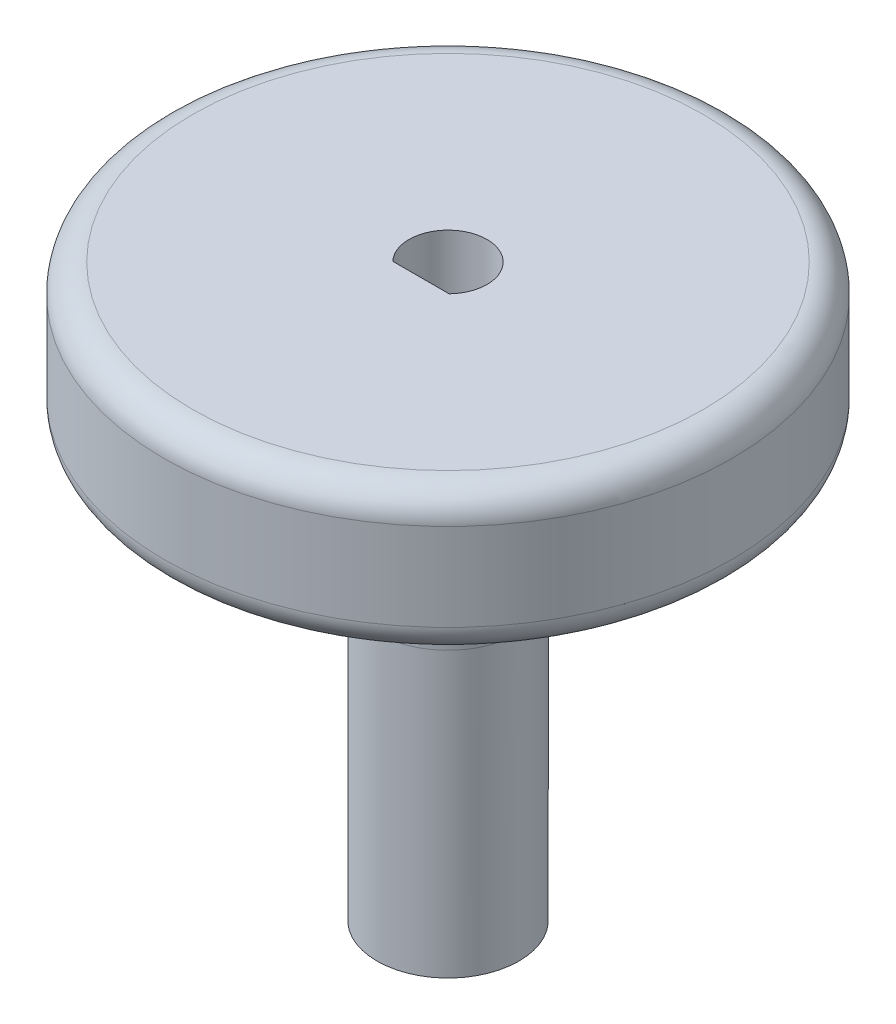
ISO-10303-21;
HEADER;
FILE_DESCRIPTION(('STEP AP214'),'2;1');
FILE_NAME('part.step','',(''),(''),'','','');
FILE_SCHEMA(('AUTOMOTIVE_DESIGN { 1 0 10303 214 1 1 1 1 }'));
ENDSEC;
DATA;
#1=APPLICATION_CONTEXT('core data for automotive mechanical design processes');
#2=APPLICATION_PROTOCOL_DEFINITION('international standard','automotive_design',2000,#1);
#3=PRODUCT_CONTEXT('',#1,'mechanical');
#4=PRODUCT('Part','Part','',(#3));
#5=PRODUCT_RELATED_PRODUCT_CATEGORY('part','',(#4));
#6=PRODUCT_DEFINITION_FORMATION('','',#4);
#7=PRODUCT_DEFINITION_CONTEXT('part definition',#1,'design');
#8=PRODUCT_DEFINITION('design','',#6,#7);
#9=PRODUCT_DEFINITION_SHAPE('','',#8);
#10=(LENGTH_UNIT() NAMED_UNIT(*) SI_UNIT(.MILLI.,.METRE.));
#11=(NAMED_UNIT(*) PLANE_ANGLE_UNIT() SI_UNIT($,.RADIAN.));
#12=(NAMED_UNIT(*) SI_UNIT($,.STERADIAN.) SOLID_ANGLE_UNIT());
#13=UNCERTAINTY_MEASURE_WITH_UNIT(LENGTH_MEASURE(1.E-05),#10,'distance_accuracy_value','');
#14=(GEOMETRIC_REPRESENTATION_CONTEXT(3) GLOBAL_UNCERTAINTY_ASSIGNED_CONTEXT((#13)) GLOBAL_UNIT_ASSIGNED_CONTEXT((#10,
#11,#12)) REPRESENTATION_CONTEXT('',''));
#15=CARTESIAN_POINT('',(0.,0.,0.));
#16=DIRECTION('',(0.,0.,1.));
#17=DIRECTION('',(1.,0.,0.));
#18=AXIS2_PLACEMENT_3D('',#15,#16,#17);
#19=CARTESIAN_POINT('',(0.,10.16,0.));
#20=DIRECTION('',(0.,-1.,0.));
#21=DIRECTION('',(0.,0.,-1.));
#22=AXIS2_PLACEMENT_3D('',#19,#20,#21);
#23=CYLINDRICAL_SURFACE('',#22,20.);
#24=CARTESIAN_POINT('',(0.,8.16,0.));
#25=DIRECTION('',(0.,1.,0.));
#26=DIRECTION('',(0.,0.,1.));
#27=AXIS2_PLACEMENT_3D('',#24,#25,#26);
#28=CIRCLE('',#27,20.);
#29=CARTESIAN_POINT('',(0.,8.16,20.));
#30=VERTEX_POINT('',#29);
#31=EDGE_CURVE('E41',#30,#30,#28,.F.);
#32=ORIENTED_EDGE('',*,*,#31,.T.);
#33=EDGE_LOOP('',(#32));
#34=FACE_BOUND('',#33,.T.);
#35=CARTESIAN_POINT('',(0.,2.,0.));
#36=DIRECTION('',(0.,1.,0.));
#37=DIRECTION('',(0.,0.,1.));
#38=AXIS2_PLACEMENT_3D('',#35,#36,#37);
#39=CIRCLE('',#38,20.);
#40=CARTESIAN_POINT('',(0.,2.,20.));
#41=VERTEX_POINT('',#40);
#42=EDGE_CURVE('E90',#41,#41,#39,.T.);
#43=ORIENTED_EDGE('',*,*,#42,.T.);
#44=EDGE_LOOP('',(#43));
#45=FACE_BOUND('',#44,.T.);
#46=ADVANCED_FACE('F33',(#34,#45),#23,.T.);
#47=CARTESIAN_POINT('',(0.,10.16,0.));
#48=DIRECTION('',(0.,1.,0.));
#49=DIRECTION('',(0.,0.,1.));
#50=AXIS2_PLACEMENT_3D('',#47,#48,#49);
#51=PLANE('',#50);
#52=CARTESIAN_POINT('',(0.,10.16,0.));
#53=DIRECTION('',(0.,1.,0.));
#54=DIRECTION('',(0.,0.,1.));
#55=AXIS2_PLACEMENT_3D('',#52,#53,#54);
#56=CIRCLE('',#55,18.);
#57=CARTESIAN_POINT('',(0.,10.16,18.));
#58=VERTEX_POINT('',#57);
#59=EDGE_CURVE('E87',#58,#58,#56,.T.);
#60=ORIENTED_EDGE('',*,*,#59,.T.);
#61=EDGE_LOOP('',(#60));
#62=FACE_BOUND('',#61,.T.);
#63=DIRECTION('',(-1.,0.,0.));
#64=VECTOR('',#63,1.);
#65=CARTESIAN_POINT('',(-1.98329901931101,10.16,1.905));
#66=LINE('',#65,#64);
#67=CARTESIAN_POINT('',(1.98329901931101,10.16,1.905));
#68=VERTEX_POINT('',#67);
#69=CARTESIAN_POINT('',(-1.98329901931101,10.16,1.905));
#70=VERTEX_POINT('',#69);
#71=EDGE_CURVE('E69',#68,#70,#66,.T.);
#72=ORIENTED_EDGE('',*,*,#71,.T.);
#73=CARTESIAN_POINT('',(0.,10.16,0.));
#74=DIRECTION('',(0.,1.,0.));
#75=DIRECTION('',(0.,0.,1.));
#76=AXIS2_PLACEMENT_3D('',#73,#74,#75);
#77=CIRCLE('',#76,2.75);
#78=EDGE_CURVE('E61',#70,#68,#77,.F.);
#79=ORIENTED_EDGE('',*,*,#78,.T.);
#80=EDGE_LOOP('',(#72,#79));
#81=FACE_BOUND('',#80,.T.);
#82=ADVANCED_FACE('F71',(#62,#81),#51,.T.);
#83=CARTESIAN_POINT('',(0.,0.,0.));
#84=DIRECTION('',(0.,1.,0.));
#85=DIRECTION('',(0.,0.,1.));
#86=AXIS2_PLACEMENT_3D('',#83,#84,#85);
#87=PLANE('',#86);
#88=CARTESIAN_POINT('',(0.,0.,0.));
#89=DIRECTION('',(0.,1.,0.));
#90=DIRECTION('',(0.,0.,1.));
#91=AXIS2_PLACEMENT_3D('',#88,#89,#90);
#92=CIRCLE('',#91,18.);
#93=CARTESIAN_POINT('',(0.,0.,18.));
#94=VERTEX_POINT('',#93);
#95=EDGE_CURVE('E11',#94,#94,#92,.F.);
#96=ORIENTED_EDGE('',*,*,#95,.T.);
#97=EDGE_LOOP('',(#96));
#98=FACE_BOUND('',#97,.T.);
#99=CARTESIAN_POINT('',(0.,0.,0.));
#100=DIRECTION('',(0.,1.,0.));
#101=DIRECTION('',(0.,0.,1.));
#102=AXIS2_PLACEMENT_3D('',#99,#100,#101);
#103=CIRCLE('',#102,15.);
#104=CARTESIAN_POINT('',(0.,0.,15.));
#105=VERTEX_POINT('',#104);
#106=EDGE_CURVE('E84',#105,#105,#103,.T.);
#107=ORIENTED_EDGE('',*,*,#106,.T.);
#108=EDGE_LOOP('',(#107));
#109=FACE_BOUND('',#108,.T.);
#110=ADVANCED_FACE('F104',(#98,#109),#87,.F.);
#111=CARTESIAN_POINT('',(0.,-30.,0.));
#112=DIRECTION('',(0.,1.,0.));
#113=DIRECTION('',(0.,0.,1.));
#114=AXIS2_PLACEMENT_3D('',#111,#112,#113);
#115=CYLINDRICAL_SURFACE('',#114,5.);
#116=CARTESIAN_POINT('',(0.,-10.,0.));
#117=DIRECTION('',(0.,1.,0.));
#118=DIRECTION('',(0.,0.,1.));
#119=AXIS2_PLACEMENT_3D('',#116,#117,#118);
#120=CIRCLE('',#119,5.);
#121=CARTESIAN_POINT('',(0.,-10.,5.));
#122=VERTEX_POINT('',#121);
#123=EDGE_CURVE('E81',#122,#122,#120,.F.);
#124=ORIENTED_EDGE('',*,*,#123,.T.);
#125=EDGE_LOOP('',(#124));
#126=FACE_BOUND('',#125,.T.);
#127=CARTESIAN_POINT('',(0.,-30.,0.));
#128=DIRECTION('',(0.,-1.,0.));
#129=DIRECTION('',(0.,0.,-1.));
#130=AXIS2_PLACEMENT_3D('',#127,#128,#129);
#131=CIRCLE('',#130,5.);
#132=CARTESIAN_POINT('',(0.,-30.,-5.));
#133=VERTEX_POINT('',#132);
#134=EDGE_CURVE('E78',#133,#133,#131,.T.);
#135=ORIENTED_EDGE('',*,*,#134,.F.);
#136=EDGE_LOOP('',(#135));
#137=FACE_BOUND('',#136,.T.);
#138=ADVANCED_FACE('F110',(#126,#137),#115,.T.);
#139=CARTESIAN_POINT('',(0.,-30.,0.));
#140=DIRECTION('',(0.,-1.,0.));
#141=DIRECTION('',(0.,0.,-1.));
#142=AXIS2_PLACEMENT_3D('',#139,#140,#141);
#143=PLANE('',#142);
#144=DIRECTION('',(-1.,0.,0.));
#145=VECTOR('',#144,1.);
#146=CARTESIAN_POINT('',(-1.98329901931101,-30.,1.905));
#147=LINE('',#146,#145);
#148=CARTESIAN_POINT('',(1.98329901931101,-30.,1.905));
#149=VERTEX_POINT('',#148);
#150=CARTESIAN_POINT('',(-1.98329901931101,-30.,1.905));
#151=VERTEX_POINT('',#150);
#152=EDGE_CURVE('E55',#149,#151,#147,.T.);
#153=ORIENTED_EDGE('',*,*,#152,.F.);
#154=CARTESIAN_POINT('',(0.,-30.,0.));
#155=DIRECTION('',(0.,-1.,0.));
#156=DIRECTION('',(0.,0.,-1.));
#157=AXIS2_PLACEMENT_3D('',#154,#155,#156);
#158=CIRCLE('',#157,2.75);
#159=EDGE_CURVE('E73',#151,#149,#158,.T.);
#160=ORIENTED_EDGE('',*,*,#159,.F.);
#161=EDGE_LOOP('',(#153,#160));
#162=FACE_BOUND('',#161,.T.);
#163=ORIENTED_EDGE('',*,*,#134,.T.);
#164=EDGE_LOOP('',(#163));
#165=FACE_BOUND('',#164,.T.);
#166=ADVANCED_FACE('F129',(#162,#165),#143,.T.);
#167=CARTESIAN_POINT('',(-1.98329901931101,17.3654857573935,1.905));
#168=DIRECTION('',(0.,0.,1.));
#169=DIRECTION('',(1.,0.,0.));
#170=AXIS2_PLACEMENT_3D('',#167,#168,#169);
#171=PLANE('',#170);
#172=DIRECTION('',(0.,-1.,0.));
#173=VECTOR('',#172,1.);
#174=CARTESIAN_POINT('',(1.98329901931101,17.3654857573935,1.905));
#175=LINE('',#174,#173);
#176=EDGE_CURVE('E48',#68,#149,#175,.T.);
#177=ORIENTED_EDGE('',*,*,#176,.T.);
#178=ORIENTED_EDGE('',*,*,#152,.T.);
#179=DIRECTION('',(0.,-1.,0.));
#180=VECTOR('',#179,1.);
#181=CARTESIAN_POINT('',(-1.98329901931101,17.3654857573935,1.905));
#182=LINE('',#181,#180);
#183=EDGE_CURVE('E63',#70,#151,#182,.T.);
#184=ORIENTED_EDGE('',*,*,#183,.F.);
#185=ORIENTED_EDGE('',*,*,#71,.F.);
#186=EDGE_LOOP('',(#177,#178,#184,#185));
#187=FACE_BOUND('',#186,.T.);
#188=ADVANCED_FACE('F68',(#187),#171,.F.);
#189=CARTESIAN_POINT('',(0.,17.3654857573935,0.));
#190=DIRECTION('',(0.,-1.,0.));
#191=DIRECTION('',(0.,0.,-1.));
#192=AXIS2_PLACEMENT_3D('',#189,#190,#191);
#193=CYLINDRICAL_SURFACE('',#192,2.75);
#194=ORIENTED_EDGE('',*,*,#183,.T.);
#195=ORIENTED_EDGE('',*,*,#159,.T.);
#196=ORIENTED_EDGE('',*,*,#176,.F.);
#197=ORIENTED_EDGE('',*,*,#78,.F.);
#198=EDGE_LOOP('',(#194,#195,#196,#197));
#199=FACE_BOUND('',#198,.T.);
#200=ADVANCED_FACE('F62',(#199),#193,.F.);
#201=CARTESIAN_POINT('',(0.,-10.,0.));
#202=DIRECTION('',(0.,1.,0.));
#203=DIRECTION('',(0.,0.,1.));
#204=AXIS2_PLACEMENT_3D('',#201,#202,#203);
#205=TOROIDAL_SURFACE('',#204,15.,10.);
#206=ORIENTED_EDGE('',*,*,#106,.F.);
#207=EDGE_LOOP('',(#206));
#208=FACE_BOUND('',#207,.T.);
#209=ORIENTED_EDGE('',*,*,#123,.F.);
#210=EDGE_LOOP('',(#209));
#211=FACE_BOUND('',#210,.T.);
#212=ADVANCED_FACE('F100',(#208,#211),#205,.F.);
#213=CARTESIAN_POINT('',(0.,8.16,0.));
#214=DIRECTION('',(0.,1.,0.));
#215=DIRECTION('',(0.,0.,1.));
#216=AXIS2_PLACEMENT_3D('',#213,#214,#215);
#217=TOROIDAL_SURFACE('',#216,18.,2.);
#218=ORIENTED_EDGE('',*,*,#31,.F.);
#219=EDGE_LOOP('',(#218));
#220=FACE_BOUND('',#219,.T.);
#221=ORIENTED_EDGE('',*,*,#59,.F.);
#222=EDGE_LOOP('',(#221));
#223=FACE_BOUND('',#222,.T.);
#224=ADVANCED_FACE('F97',(#220,#223),#217,.T.);
#225=CARTESIAN_POINT('',(0.,2.,0.));
#226=DIRECTION('',(0.,1.,0.));
#227=DIRECTION('',(0.,0.,1.));
#228=AXIS2_PLACEMENT_3D('',#225,#226,#227);
#229=TOROIDAL_SURFACE('',#228,18.,2.);
#230=ORIENTED_EDGE('',*,*,#95,.F.);
#231=EDGE_LOOP('',(#230));
#232=FACE_BOUND('',#231,.T.);
#233=ORIENTED_EDGE('',*,*,#42,.F.);
#234=EDGE_LOOP('',(#233));
#235=FACE_BOUND('',#234,.T.);
#236=ADVANCED_FACE('F35',(#232,#235),#229,.T.);
#237=CLOSED_SHELL('',(#46,#82,#110,#138,#166,#188,#200,#212,#224,#236));
#238=MANIFOLD_SOLID_BREP('B2',#237);
#239=ADVANCED_BREP_SHAPE_REPRESENTATION('',(#18,#238),#14);
#240=SHAPE_DEFINITION_REPRESENTATION(#9,#239);
ENDSEC;
END-ISO-10303-21;
